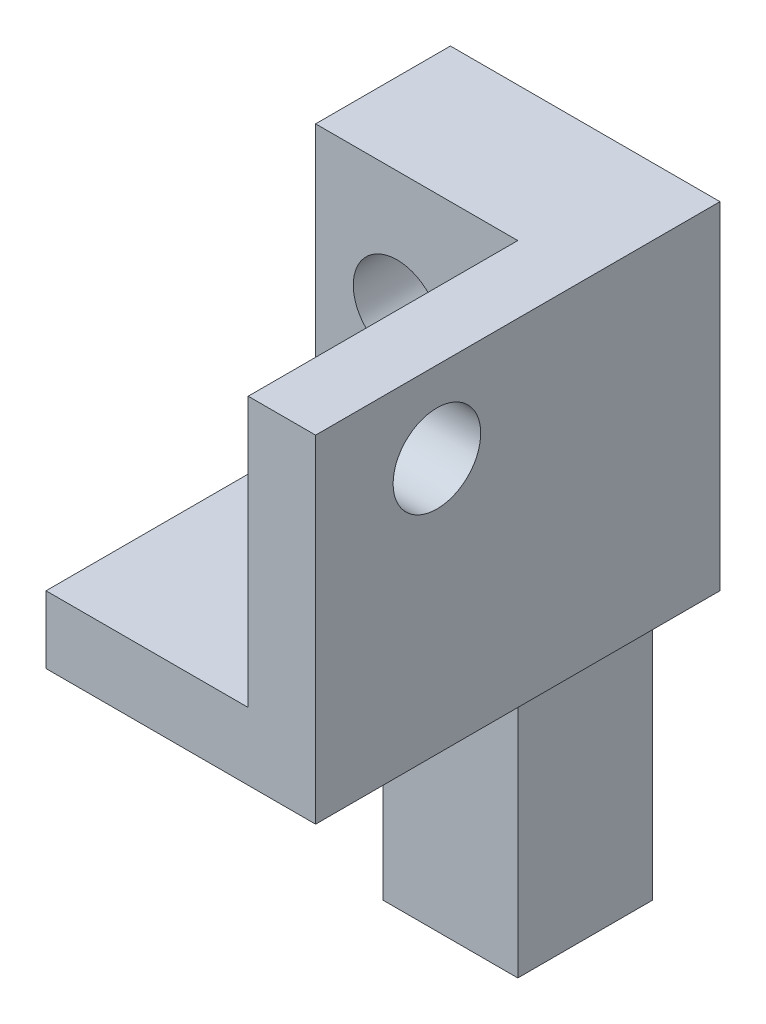
ISO-10303-21;
HEADER;
FILE_DESCRIPTION(('STEP AP214'),'2;1');
FILE_NAME('part.step','',(''),(''),'','','');
FILE_SCHEMA(('AUTOMOTIVE_DESIGN { 1 0 10303 214 1 1 1 1 }'));
ENDSEC;
DATA;
#1=APPLICATION_CONTEXT('core data for automotive mechanical design processes');
#2=APPLICATION_PROTOCOL_DEFINITION('international standard','automotive_design',2000,#1);
#3=PRODUCT_CONTEXT('',#1,'mechanical');
#4=PRODUCT('Part','Part','',(#3));
#5=PRODUCT_RELATED_PRODUCT_CATEGORY('part','',(#4));
#6=PRODUCT_DEFINITION_FORMATION('','',#4);
#7=PRODUCT_DEFINITION_CONTEXT('part definition',#1,'design');
#8=PRODUCT_DEFINITION('design','',#6,#7);
#9=PRODUCT_DEFINITION_SHAPE('','',#8);
#10=(LENGTH_UNIT() NAMED_UNIT(*) SI_UNIT(.MILLI.,.METRE.));
#11=(NAMED_UNIT(*) PLANE_ANGLE_UNIT() SI_UNIT($,.RADIAN.));
#12=(NAMED_UNIT(*) SI_UNIT($,.STERADIAN.) SOLID_ANGLE_UNIT());
#13=UNCERTAINTY_MEASURE_WITH_UNIT(LENGTH_MEASURE(1.E-05),#10,'distance_accuracy_value','');
#14=(GEOMETRIC_REPRESENTATION_CONTEXT(3) GLOBAL_UNCERTAINTY_ASSIGNED_CONTEXT((#13)) GLOBAL_UNIT_ASSIGNED_CONTEXT((#10,
#11,#12)) REPRESENTATION_CONTEXT('',''));
#15=CARTESIAN_POINT('',(0.,0.,0.));
#16=DIRECTION('',(0.,0.,1.));
#17=DIRECTION('',(1.,0.,0.));
#18=AXIS2_PLACEMENT_3D('',#15,#16,#17);
#19=CARTESIAN_POINT('',(0.,0.,0.));
#20=DIRECTION('',(1.,0.,0.));
#21=DIRECTION('',(0.,0.,-1.));
#22=AXIS2_PLACEMENT_3D('',#19,#20,#21);
#23=PLANE('',#22);
#24=DIRECTION('',(0.,0.,1.));
#25=VECTOR('',#24,1.);
#26=CARTESIAN_POINT('',(0.,-25.,30.));
#27=LINE('',#26,#25);
#28=CARTESIAN_POINT('',(0.,-25.,0.));
#29=VERTEX_POINT('',#28);
#30=CARTESIAN_POINT('',(0.,-25.,10.));
#31=VERTEX_POINT('',#30);
#32=EDGE_CURVE('E117',#29,#31,#27,.T.);
#33=ORIENTED_EDGE('',*,*,#32,.F.);
#34=DIRECTION('',(0.,1.,0.));
#35=VECTOR('',#34,1.);
#36=CARTESIAN_POINT('',(0.,-47.38,0.));
#37=LINE('',#36,#35);
#38=CARTESIAN_POINT('',(0.,-47.38,0.));
#39=VERTEX_POINT('',#38);
#40=EDGE_CURVE('E131',#39,#29,#37,.T.);
#41=ORIENTED_EDGE('',*,*,#40,.F.);
#42=DIRECTION('',(0.,0.,-1.));
#43=VECTOR('',#42,1.);
#44=CARTESIAN_POINT('',(0.,-47.38,10.));
#45=LINE('',#44,#43);
#46=CARTESIAN_POINT('',(0.,-47.38,10.));
#47=VERTEX_POINT('',#46);
#48=EDGE_CURVE('E82',#47,#39,#45,.T.);
#49=ORIENTED_EDGE('',*,*,#48,.F.);
#50=DIRECTION('',(0.,-1.,0.));
#51=VECTOR('',#50,1.);
#52=CARTESIAN_POINT('',(0.,-25.,10.));
#53=LINE('',#52,#51);
#54=EDGE_CURVE('E76',#31,#47,#53,.T.);
#55=ORIENTED_EDGE('',*,*,#54,.F.);
#56=EDGE_LOOP('',(#33,#41,#49,#55));
#57=FACE_BOUND('',#56,.T.);
#58=ADVANCED_FACE('F42',(#57),#23,.F.);
#59=CARTESIAN_POINT('',(10.,-47.38,0.));
#60=DIRECTION('',(0.,0.,1.));
#61=DIRECTION('',(1.,0.,0.));
#62=AXIS2_PLACEMENT_3D('',#59,#60,#61);
#63=PLANE('',#62);
#64=CARTESIAN_POINT('',(1.04408728882194,-8.96407559332862,0.));
#65=DIRECTION('',(0.,0.,1.));
#66=DIRECTION('',(1.,0.,0.));
#67=AXIS2_PLACEMENT_3D('',#64,#65,#66);
#68=CIRCLE('',#67,3.24999999999995);
#69=CARTESIAN_POINT('',(4.29408728882189,-8.96407559332862,0.));
#70=VERTEX_POINT('',#69);
#71=EDGE_CURVE('E150',#70,#70,#68,.F.);
#72=ORIENTED_EDGE('',*,*,#71,.F.);
#73=EDGE_LOOP('',(#72));
#74=FACE_BOUND('',#73,.T.);
#75=ORIENTED_EDGE('',*,*,#40,.T.);
#76=DIRECTION('',(1.,0.,0.));
#77=VECTOR('',#76,1.);
#78=CARTESIAN_POINT('',(-5.,-25.,0.));
#79=LINE('',#78,#77);
#80=CARTESIAN_POINT('',(-5.,-25.,0.));
#81=VERTEX_POINT('',#80);
#82=EDGE_CURVE('E134',#81,#29,#79,.T.);
#83=ORIENTED_EDGE('',*,*,#82,.F.);
#84=DIRECTION('',(0.,-1.,0.));
#85=VECTOR('',#84,1.);
#86=CARTESIAN_POINT('',(-5.,-25.,0.));
#87=LINE('',#86,#85);
#88=CARTESIAN_POINT('',(-5.,0.,0.));
#89=VERTEX_POINT('',#88);
#90=EDGE_CURVE('E184',#89,#81,#87,.T.);
#91=ORIENTED_EDGE('',*,*,#90,.F.);
#92=DIRECTION('',(-1.,0.,0.));
#93=VECTOR('',#92,1.);
#94=CARTESIAN_POINT('',(10.,0.,0.));
#95=LINE('',#94,#93);
#96=CARTESIAN_POINT('',(15.,0.,0.));
#97=VERTEX_POINT('',#96);
#98=EDGE_CURVE('E52',#97,#89,#95,.T.);
#99=ORIENTED_EDGE('',*,*,#98,.F.);
#100=DIRECTION('',(0.,1.,0.));
#101=VECTOR('',#100,1.);
#102=CARTESIAN_POINT('',(15.,0.,0.));
#103=LINE('',#102,#101);
#104=CARTESIAN_POINT('',(15.,-25.,0.));
#105=VERTEX_POINT('',#104);
#106=EDGE_CURVE('E163',#105,#97,#103,.T.);
#107=ORIENTED_EDGE('',*,*,#106,.F.);
#108=DIRECTION('',(-1.,0.,0.));
#109=VECTOR('',#108,1.);
#110=CARTESIAN_POINT('',(15.,-25.,0.));
#111=LINE('',#110,#109);
#112=CARTESIAN_POINT('',(10.,-25.,0.));
#113=VERTEX_POINT('',#112);
#114=EDGE_CURVE('E176',#105,#113,#111,.T.);
#115=ORIENTED_EDGE('',*,*,#114,.T.);
#116=DIRECTION('',(0.,1.,0.));
#117=VECTOR('',#116,1.);
#118=CARTESIAN_POINT('',(10.,-47.38,0.));
#119=LINE('',#118,#117);
#120=CARTESIAN_POINT('',(10.,-47.38,0.));
#121=VERTEX_POINT('',#120);
#122=EDGE_CURVE('E108',#121,#113,#119,.T.);
#123=ORIENTED_EDGE('',*,*,#122,.F.);
#124=DIRECTION('',(-1.,0.,0.));
#125=VECTOR('',#124,1.);
#126=CARTESIAN_POINT('',(10.,-47.38,0.));
#127=LINE('',#126,#125);
#128=EDGE_CURVE('E124',#121,#39,#127,.T.);
#129=ORIENTED_EDGE('',*,*,#128,.T.);
#130=EDGE_LOOP('',(#75,#83,#91,#99,#107,#115,#123,#129));
#131=FACE_BOUND('',#130,.T.);
#132=ADVANCED_FACE('F44',(#74,#131),#63,.F.);
#133=CARTESIAN_POINT('',(10.,0.,0.));
#134=DIRECTION('',(0.,-1.,0.));
#135=DIRECTION('',(0.,0.,-1.));
#136=AXIS2_PLACEMENT_3D('',#133,#134,#135);
#137=PLANE('',#136);
#138=ORIENTED_EDGE('',*,*,#98,.T.);
#139=DIRECTION('',(0.,0.,-1.));
#140=VECTOR('',#139,1.);
#141=CARTESIAN_POINT('',(-5.,0.,0.));
#142=LINE('',#141,#140);
#143=CARTESIAN_POINT('',(-5.,0.,10.));
#144=VERTEX_POINT('',#143);
#145=EDGE_CURVE('E199',#144,#89,#142,.T.);
#146=ORIENTED_EDGE('',*,*,#145,.F.);
#147=DIRECTION('',(-1.,0.,0.));
#148=VECTOR('',#147,1.);
#149=CARTESIAN_POINT('',(10.,0.,10.));
#150=LINE('',#149,#148);
#151=CARTESIAN_POINT('',(10.,0.,10.));
#152=VERTEX_POINT('',#151);
#153=EDGE_CURVE('E91',#152,#144,#150,.T.);
#154=ORIENTED_EDGE('',*,*,#153,.F.);
#155=DIRECTION('',(0.,0.,1.));
#156=VECTOR('',#155,1.);
#157=CARTESIAN_POINT('',(10.,0.,0.));
#158=LINE('',#157,#156);
#159=CARTESIAN_POINT('',(10.,0.,30.));
#160=VERTEX_POINT('',#159);
#161=EDGE_CURVE('E155',#152,#160,#158,.T.);
#162=ORIENTED_EDGE('',*,*,#161,.T.);
#163=DIRECTION('',(-1.,0.,0.));
#164=VECTOR('',#163,1.);
#165=CARTESIAN_POINT('',(15.,0.,30.));
#166=LINE('',#165,#164);
#167=CARTESIAN_POINT('',(15.,0.,30.));
#168=VERTEX_POINT('',#167);
#169=EDGE_CURVE('E181',#168,#160,#166,.T.);
#170=ORIENTED_EDGE('',*,*,#169,.F.);
#171=DIRECTION('',(0.,0.,1.));
#172=VECTOR('',#171,1.);
#173=CARTESIAN_POINT('',(15.,0.,0.));
#174=LINE('',#173,#172);
#175=EDGE_CURVE('E166',#97,#168,#174,.T.);
#176=ORIENTED_EDGE('',*,*,#175,.F.);
#177=EDGE_LOOP('',(#138,#146,#154,#162,#170,#176));
#178=FACE_BOUND('',#177,.T.);
#179=ADVANCED_FACE('F241',(#178),#137,.F.);
#180=CARTESIAN_POINT('',(10.,0.,10.));
#181=DIRECTION('',(0.,0.,-1.));
#182=DIRECTION('',(0.,1.,0.));
#183=AXIS2_PLACEMENT_3D('',#180,#181,#182);
#184=PLANE('',#183);
#185=CARTESIAN_POINT('',(1.04408728882194,-8.96407559332862,10.));
#186=DIRECTION('',(0.,0.,-1.));
#187=DIRECTION('',(0.,1.,0.));
#188=AXIS2_PLACEMENT_3D('',#185,#186,#187);
#189=CIRCLE('',#188,3.24999999999995);
#190=CARTESIAN_POINT('',(1.04408728882194,-5.71407559332867,10.));
#191=VERTEX_POINT('',#190);
#192=EDGE_CURVE('E148',#191,#191,#189,.F.);
#193=ORIENTED_EDGE('',*,*,#192,.F.);
#194=EDGE_LOOP('',(#193));
#195=FACE_BOUND('',#194,.T.);
#196=ORIENTED_EDGE('',*,*,#153,.T.);
#197=DIRECTION('',(0.,1.,0.));
#198=VECTOR('',#197,1.);
#199=CARTESIAN_POINT('',(-5.,0.,10.));
#200=LINE('',#199,#198);
#201=CARTESIAN_POINT('',(-5.,-20.,10.));
#202=VERTEX_POINT('',#201);
#203=EDGE_CURVE('E196',#202,#144,#200,.T.);
#204=ORIENTED_EDGE('',*,*,#203,.F.);
#205=DIRECTION('',(-1.,0.,0.));
#206=VECTOR('',#205,1.);
#207=CARTESIAN_POINT('',(10.,-20.,10.));
#208=LINE('',#207,#206);
#209=CARTESIAN_POINT('',(10.,-20.,10.));
#210=VERTEX_POINT('',#209);
#211=EDGE_CURVE('E143',#210,#202,#208,.T.);
#212=ORIENTED_EDGE('',*,*,#211,.F.);
#213=DIRECTION('',(0.,-1.,0.));
#214=VECTOR('',#213,1.);
#215=CARTESIAN_POINT('',(10.,0.,10.));
#216=LINE('',#215,#214);
#217=EDGE_CURVE('E127',#152,#210,#216,.T.);
#218=ORIENTED_EDGE('',*,*,#217,.F.);
#219=EDGE_LOOP('',(#196,#204,#212,#218));
#220=FACE_BOUND('',#219,.T.);
#221=ADVANCED_FACE('F211',(#195,#220),#184,.F.);
#222=CARTESIAN_POINT('',(10.,-20.,10.));
#223=DIRECTION('',(0.,-1.,0.));
#224=DIRECTION('',(0.,0.,-1.));
#225=AXIS2_PLACEMENT_3D('',#222,#223,#224);
#226=PLANE('',#225);
#227=ORIENTED_EDGE('',*,*,#211,.T.);
#228=DIRECTION('',(0.,0.,-1.));
#229=VECTOR('',#228,1.);
#230=CARTESIAN_POINT('',(-5.,-20.,10.));
#231=LINE('',#230,#229);
#232=CARTESIAN_POINT('',(-5.,-20.,30.));
#233=VERTEX_POINT('',#232);
#234=EDGE_CURVE('E193',#233,#202,#231,.T.);
#235=ORIENTED_EDGE('',*,*,#234,.F.);
#236=DIRECTION('',(-1.,0.,0.));
#237=VECTOR('',#236,1.);
#238=CARTESIAN_POINT('',(10.,-20.,30.));
#239=LINE('',#238,#237);
#240=CARTESIAN_POINT('',(10.,-20.,30.));
#241=VERTEX_POINT('',#240);
#242=EDGE_CURVE('E140',#241,#233,#239,.T.);
#243=ORIENTED_EDGE('',*,*,#242,.F.);
#244=DIRECTION('',(0.,0.,1.));
#245=VECTOR('',#244,1.);
#246=CARTESIAN_POINT('',(10.,-20.,10.));
#247=LINE('',#246,#245);
#248=EDGE_CURVE('E122',#210,#241,#247,.T.);
#249=ORIENTED_EDGE('',*,*,#248,.F.);
#250=EDGE_LOOP('',(#227,#235,#243,#249));
#251=FACE_BOUND('',#250,.T.);
#252=ADVANCED_FACE('F217',(#251),#226,.F.);
#253=CARTESIAN_POINT('',(10.,-20.,30.));
#254=DIRECTION('',(0.,0.,-1.));
#255=DIRECTION('',(0.,1.,0.));
#256=AXIS2_PLACEMENT_3D('',#253,#254,#255);
#257=PLANE('',#256);
#258=ORIENTED_EDGE('',*,*,#242,.T.);
#259=DIRECTION('',(0.,1.,0.));
#260=VECTOR('',#259,1.);
#261=CARTESIAN_POINT('',(-5.,-20.,30.));
#262=LINE('',#261,#260);
#263=CARTESIAN_POINT('',(-5.,-25.,30.));
#264=VERTEX_POINT('',#263);
#265=EDGE_CURVE('E190',#264,#233,#262,.T.);
#266=ORIENTED_EDGE('',*,*,#265,.F.);
#267=DIRECTION('',(-1.,0.,0.));
#268=VECTOR('',#267,1.);
#269=CARTESIAN_POINT('',(10.,-25.,30.));
#270=LINE('',#269,#268);
#271=CARTESIAN_POINT('',(15.,-25.,30.));
#272=VERTEX_POINT('',#271);
#273=EDGE_CURVE('E118',#272,#264,#270,.T.);
#274=ORIENTED_EDGE('',*,*,#273,.F.);
#275=DIRECTION('',(0.,-1.,0.));
#276=VECTOR('',#275,1.);
#277=CARTESIAN_POINT('',(15.,0.,30.));
#278=LINE('',#277,#276);
#279=EDGE_CURVE('E170',#168,#272,#278,.T.);
#280=ORIENTED_EDGE('',*,*,#279,.F.);
#281=ORIENTED_EDGE('',*,*,#169,.T.);
#282=DIRECTION('',(0.,-1.,0.));
#283=VECTOR('',#282,1.);
#284=CARTESIAN_POINT('',(10.,0.,30.));
#285=LINE('',#284,#283);
#286=EDGE_CURVE('E167',#160,#241,#285,.T.);
#287=ORIENTED_EDGE('',*,*,#286,.T.);
#288=EDGE_LOOP('',(#258,#266,#274,#280,#281,#287));
#289=FACE_BOUND('',#288,.T.);
#290=ADVANCED_FACE('F221',(#289),#257,.F.);
#291=CARTESIAN_POINT('',(10.,-25.,30.));
#292=DIRECTION('',(0.,1.,0.));
#293=DIRECTION('',(0.,0.,1.));
#294=AXIS2_PLACEMENT_3D('',#291,#292,#293);
#295=PLANE('',#294);
#296=ORIENTED_EDGE('',*,*,#273,.T.);
#297=DIRECTION('',(0.,0.,1.));
#298=VECTOR('',#297,1.);
#299=CARTESIAN_POINT('',(-5.,-25.,30.));
#300=LINE('',#299,#298);
#301=EDGE_CURVE('E187',#81,#264,#300,.T.);
#302=ORIENTED_EDGE('',*,*,#301,.F.);
#303=ORIENTED_EDGE('',*,*,#82,.T.);
#304=ORIENTED_EDGE('',*,*,#32,.T.);
#305=DIRECTION('',(-1.,0.,0.));
#306=VECTOR('',#305,1.);
#307=CARTESIAN_POINT('',(10.,-25.,10.));
#308=LINE('',#307,#306);
#309=CARTESIAN_POINT('',(10.,-25.,10.));
#310=VERTEX_POINT('',#309);
#311=EDGE_CURVE('E112',#310,#31,#308,.T.);
#312=ORIENTED_EDGE('',*,*,#311,.F.);
#313=DIRECTION('',(0.,0.,-1.));
#314=VECTOR('',#313,1.);
#315=CARTESIAN_POINT('',(10.,-25.,0.));
#316=LINE('',#315,#314);
#317=EDGE_CURVE('E11',#310,#113,#316,.T.);
#318=ORIENTED_EDGE('',*,*,#317,.T.);
#319=ORIENTED_EDGE('',*,*,#114,.F.);
#320=DIRECTION('',(0.,0.,-1.));
#321=VECTOR('',#320,1.);
#322=CARTESIAN_POINT('',(15.,-25.,0.));
#323=LINE('',#322,#321);
#324=EDGE_CURVE('E173',#272,#105,#323,.T.);
#325=ORIENTED_EDGE('',*,*,#324,.F.);
#326=EDGE_LOOP('',(#296,#302,#303,#304,#312,#318,#319,#325));
#327=FACE_BOUND('',#326,.T.);
#328=ADVANCED_FACE('F114',(#327),#295,.F.);
#329=CARTESIAN_POINT('',(10.,-25.,10.));
#330=DIRECTION('',(0.,0.,-1.));
#331=DIRECTION('',(0.,1.,0.));
#332=AXIS2_PLACEMENT_3D('',#329,#330,#331);
#333=PLANE('',#332);
#334=ORIENTED_EDGE('',*,*,#54,.T.);
#335=DIRECTION('',(-1.,0.,0.));
#336=VECTOR('',#335,1.);
#337=CARTESIAN_POINT('',(10.,-47.38,10.));
#338=LINE('',#337,#336);
#339=CARTESIAN_POINT('',(10.,-47.38,10.));
#340=VERTEX_POINT('',#339);
#341=EDGE_CURVE('E119',#340,#47,#338,.T.);
#342=ORIENTED_EDGE('',*,*,#341,.F.);
#343=DIRECTION('',(0.,-1.,0.));
#344=VECTOR('',#343,1.);
#345=CARTESIAN_POINT('',(10.,-25.,10.));
#346=LINE('',#345,#344);
#347=EDGE_CURVE('E105',#310,#340,#346,.T.);
#348=ORIENTED_EDGE('',*,*,#347,.F.);
#349=ORIENTED_EDGE('',*,*,#311,.T.);
#350=EDGE_LOOP('',(#334,#342,#348,#349));
#351=FACE_BOUND('',#350,.T.);
#352=ADVANCED_FACE('F121',(#351),#333,.F.);
#353=CARTESIAN_POINT('',(10.,-47.38,10.));
#354=DIRECTION('',(0.,1.,0.));
#355=DIRECTION('',(0.,0.,1.));
#356=AXIS2_PLACEMENT_3D('',#353,#354,#355);
#357=PLANE('',#356);
#358=ORIENTED_EDGE('',*,*,#48,.T.);
#359=ORIENTED_EDGE('',*,*,#128,.F.);
#360=DIRECTION('',(0.,0.,-1.));
#361=VECTOR('',#360,1.);
#362=CARTESIAN_POINT('',(10.,-47.38,10.));
#363=LINE('',#362,#361);
#364=EDGE_CURVE('E61',#340,#121,#363,.T.);
#365=ORIENTED_EDGE('',*,*,#364,.F.);
#366=ORIENTED_EDGE('',*,*,#341,.T.);
#367=EDGE_LOOP('',(#358,#359,#365,#366));
#368=FACE_BOUND('',#367,.T.);
#369=ADVANCED_FACE('F259',(#368),#357,.F.);
#370=CARTESIAN_POINT('',(10.,0.,0.));
#371=DIRECTION('',(1.,0.,0.));
#372=DIRECTION('',(0.,0.,-1.));
#373=AXIS2_PLACEMENT_3D('',#370,#371,#372);
#374=PLANE('',#373);
#375=ORIENTED_EDGE('',*,*,#317,.F.);
#376=ORIENTED_EDGE('',*,*,#347,.T.);
#377=ORIENTED_EDGE('',*,*,#364,.T.);
#378=ORIENTED_EDGE('',*,*,#122,.T.);
#379=EDGE_LOOP('',(#375,#376,#377,#378));
#380=FACE_BOUND('',#379,.T.);
#381=ADVANCED_FACE('F103',(#380),#374,.T.);
#382=CARTESIAN_POINT('',(-5.,0.,0.));
#383=DIRECTION('',(1.,0.,0.));
#384=DIRECTION('',(0.,0.,-1.));
#385=AXIS2_PLACEMENT_3D('',#382,#383,#384);
#386=PLANE('',#385);
#387=ORIENTED_EDGE('',*,*,#90,.T.);
#388=ORIENTED_EDGE('',*,*,#301,.T.);
#389=ORIENTED_EDGE('',*,*,#265,.T.);
#390=ORIENTED_EDGE('',*,*,#234,.T.);
#391=ORIENTED_EDGE('',*,*,#203,.T.);
#392=ORIENTED_EDGE('',*,*,#145,.T.);
#393=EDGE_LOOP('',(#387,#388,#389,#390,#391,#392));
#394=FACE_BOUND('',#393,.T.);
#395=ADVANCED_FACE('F226',(#394),#386,.F.);
#396=CARTESIAN_POINT('',(15.,0.,0.));
#397=DIRECTION('',(-1.,0.,0.));
#398=DIRECTION('',(0.,0.,1.));
#399=AXIS2_PLACEMENT_3D('',#396,#397,#398);
#400=PLANE('',#399);
#401=CARTESIAN_POINT('',(15.,-5.99999999999997,21.0000000000001));
#402=DIRECTION('',(-1.,0.,0.));
#403=DIRECTION('',(0.,0.,1.));
#404=AXIS2_PLACEMENT_3D('',#401,#402,#403);
#405=CIRCLE('',#404,3.24999999999991);
#406=CARTESIAN_POINT('',(15.,-5.99999999999997,24.25));
#407=VERTEX_POINT('',#406);
#408=EDGE_CURVE('E151',#407,#407,#405,.F.);
#409=ORIENTED_EDGE('',*,*,#408,.F.);
#410=EDGE_LOOP('',(#409));
#411=FACE_BOUND('',#410,.T.);
#412=ORIENTED_EDGE('',*,*,#106,.T.);
#413=ORIENTED_EDGE('',*,*,#175,.T.);
#414=ORIENTED_EDGE('',*,*,#279,.T.);
#415=ORIENTED_EDGE('',*,*,#324,.T.);
#416=EDGE_LOOP('',(#412,#413,#414,#415));
#417=FACE_BOUND('',#416,.T.);
#418=ADVANCED_FACE('F331',(#411,#417),#400,.F.);
#419=CARTESIAN_POINT('',(10.,0.,0.));
#420=DIRECTION('',(-1.,0.,0.));
#421=DIRECTION('',(0.,0.,1.));
#422=AXIS2_PLACEMENT_3D('',#419,#420,#421);
#423=PLANE('',#422);
#424=CARTESIAN_POINT('',(10.,-5.99999999999997,21.0000000000001));
#425=DIRECTION('',(-1.,0.,0.));
#426=DIRECTION('',(0.,0.,1.));
#427=AXIS2_PLACEMENT_3D('',#424,#425,#426);
#428=CIRCLE('',#427,3.24999999999991);
#429=CARTESIAN_POINT('',(10.,-5.99999999999997,24.25));
#430=VERTEX_POINT('',#429);
#431=EDGE_CURVE('E46',#430,#430,#428,.F.);
#432=ORIENTED_EDGE('',*,*,#431,.T.);
#433=EDGE_LOOP('',(#432));
#434=FACE_BOUND('',#433,.T.);
#435=ORIENTED_EDGE('',*,*,#161,.F.);
#436=ORIENTED_EDGE('',*,*,#217,.T.);
#437=ORIENTED_EDGE('',*,*,#248,.T.);
#438=ORIENTED_EDGE('',*,*,#286,.F.);
#439=EDGE_LOOP('',(#435,#436,#437,#438));
#440=FACE_BOUND('',#439,.T.);
#441=ADVANCED_FACE('F207',(#434,#440),#423,.T.);
#442=CARTESIAN_POINT('',(1.04408728882194,-8.96407559332862,-22.));
#443=DIRECTION('',(0.,0.,1.));
#444=DIRECTION('',(1.,0.,0.));
#445=AXIS2_PLACEMENT_3D('',#442,#443,#444);
#446=CYLINDRICAL_SURFACE('',#445,3.24999999999995);
#447=ORIENTED_EDGE('',*,*,#192,.T.);
#448=EDGE_LOOP('',(#447));
#449=FACE_BOUND('',#448,.T.);
#450=ORIENTED_EDGE('',*,*,#71,.T.);
#451=EDGE_LOOP('',(#450));
#452=FACE_BOUND('',#451,.T.);
#453=ADVANCED_FACE('F320',(#449,#452),#446,.F.);
#454=CARTESIAN_POINT('',(31.,-5.99999999999997,21.0000000000001));
#455=DIRECTION('',(-1.,0.,0.));
#456=DIRECTION('',(0.,0.,1.));
#457=AXIS2_PLACEMENT_3D('',#454,#455,#456);
#458=CYLINDRICAL_SURFACE('',#457,3.24999999999991);
#459=ORIENTED_EDGE('',*,*,#431,.F.);
#460=EDGE_LOOP('',(#459));
#461=FACE_BOUND('',#460,.T.);
#462=ORIENTED_EDGE('',*,*,#408,.T.);
#463=EDGE_LOOP('',(#462));
#464=FACE_BOUND('',#463,.T.);
#465=ADVANCED_FACE('F324',(#461,#464),#458,.F.);
#466=CLOSED_SHELL('',(#58,#132,#179,#221,#252,#290,#328,#352,#369,#381,#395,#418,#441,#453,#465));
#467=MANIFOLD_SOLID_BREP('B2',#466);
#468=ADVANCED_BREP_SHAPE_REPRESENTATION('',(#18,#467),#14);
#469=SHAPE_DEFINITION_REPRESENTATION(#9,#468);
ENDSEC;
END-ISO-10303-21;
